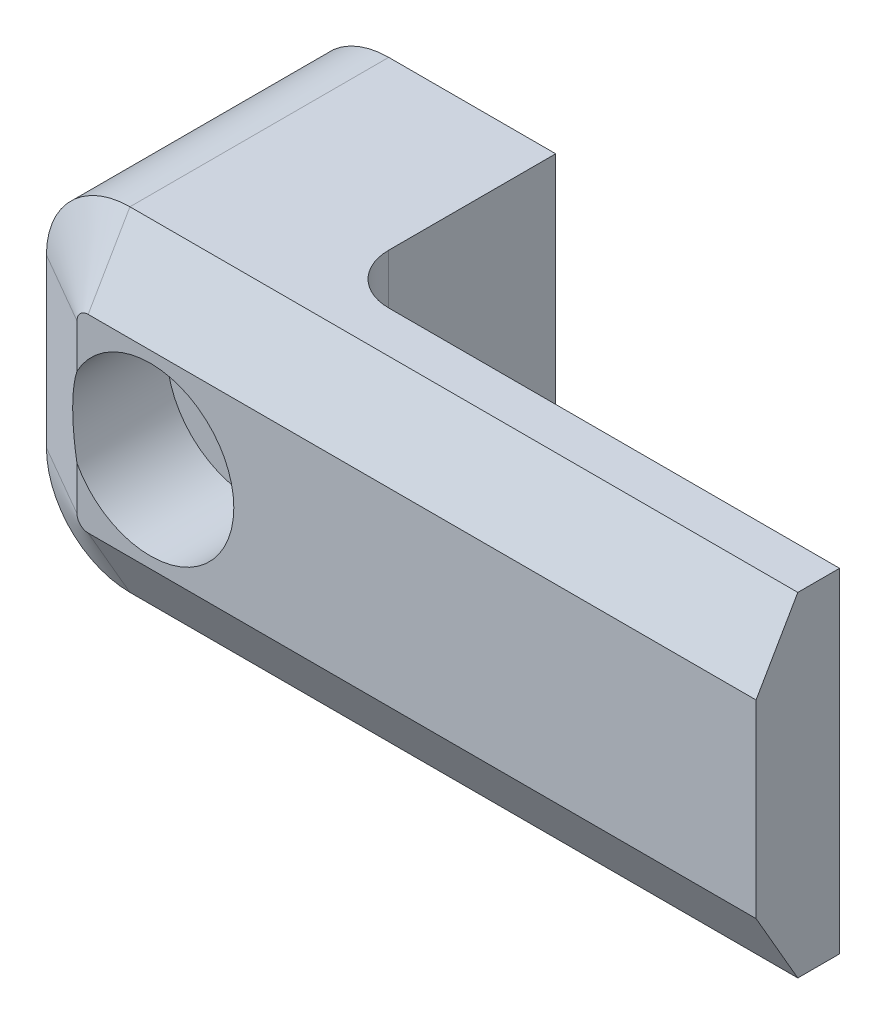
ISO-10303-21;
HEADER;
FILE_DESCRIPTION(('STEP AP214'),'2;1');
FILE_NAME('part.step','',(''),(''),'','','');
FILE_SCHEMA(('AUTOMOTIVE_DESIGN { 1 0 10303 214 1 1 1 1 }'));
ENDSEC;
DATA;
#1=APPLICATION_CONTEXT('core data for automotive mechanical design processes');
#2=APPLICATION_PROTOCOL_DEFINITION('international standard','automotive_design',2000,#1);
#3=PRODUCT_CONTEXT('',#1,'mechanical');
#4=PRODUCT('Part','Part','',(#3));
#5=PRODUCT_RELATED_PRODUCT_CATEGORY('part','',(#4));
#6=PRODUCT_DEFINITION_FORMATION('','',#4);
#7=PRODUCT_DEFINITION_CONTEXT('part definition',#1,'design');
#8=PRODUCT_DEFINITION('design','',#6,#7);
#9=PRODUCT_DEFINITION_SHAPE('','',#8);
#10=(LENGTH_UNIT() NAMED_UNIT(*) SI_UNIT(.MILLI.,.METRE.));
#11=(NAMED_UNIT(*) PLANE_ANGLE_UNIT() SI_UNIT($,.RADIAN.));
#12=(NAMED_UNIT(*) SI_UNIT($,.STERADIAN.) SOLID_ANGLE_UNIT());
#13=UNCERTAINTY_MEASURE_WITH_UNIT(LENGTH_MEASURE(1.E-05),#10,'distance_accuracy_value','');
#14=(GEOMETRIC_REPRESENTATION_CONTEXT(3) GLOBAL_UNCERTAINTY_ASSIGNED_CONTEXT((#13)) GLOBAL_UNIT_ASSIGNED_CONTEXT((#10,
#11,#12)) REPRESENTATION_CONTEXT('',''));
#15=CARTESIAN_POINT('',(0.,0.,0.));
#16=DIRECTION('',(0.,0.,1.));
#17=DIRECTION('',(1.,0.,0.));
#18=AXIS2_PLACEMENT_3D('',#15,#16,#17);
#19=CARTESIAN_POINT('',(-4.5,10.,-3.));
#20=DIRECTION('',(0.,1.,0.));
#21=DIRECTION('',(-1.,0.,0.));
#22=AXIS2_PLACEMENT_3D('',#19,#20,#21);
#23=CYLINDRICAL_SURFACE('',#22,3.);
#24=DIRECTION('',(0.,-1.,0.));
#25=VECTOR('',#24,1.);
#26=CARTESIAN_POINT('',(-7.5,10.,-3.));
#27=LINE('',#26,#25);
#28=CARTESIAN_POINT('',(-7.5,10.,-3.));
#29=VERTEX_POINT('',#28);
#30=CARTESIAN_POINT('',(-7.50000000000001,-10.,-3.));
#31=VERTEX_POINT('',#30);
#32=EDGE_CURVE('E165',#29,#31,#27,.T.);
#33=ORIENTED_EDGE('',*,*,#32,.F.);
#34=CARTESIAN_POINT('',(-4.5,10.,-3.));
#35=DIRECTION('',(0.,-1.,0.));
#36=DIRECTION('',(1.,0.,0.));
#37=AXIS2_PLACEMENT_3D('',#34,#35,#36);
#38=CIRCLE('',#37,3.);
#39=CARTESIAN_POINT('',(-4.5,10.,0.));
#40=VERTEX_POINT('',#39);
#41=EDGE_CURVE('E39',#29,#40,#38,.F.);
#42=ORIENTED_EDGE('',*,*,#41,.T.);
#43=DIRECTION('',(0.,-1.,0.));
#44=VECTOR('',#43,1.);
#45=CARTESIAN_POINT('',(-4.5,10.,0.));
#46=LINE('',#45,#44);
#47=CARTESIAN_POINT('',(-4.5,-10.,0.));
#48=VERTEX_POINT('',#47);
#49=EDGE_CURVE('E167',#48,#40,#46,.F.);
#50=ORIENTED_EDGE('',*,*,#49,.F.);
#51=CARTESIAN_POINT('',(-4.50000000000001,-10.,-3.));
#52=DIRECTION('',(0.,1.,0.));
#53=DIRECTION('',(-1.,0.,0.));
#54=AXIS2_PLACEMENT_3D('',#51,#52,#53);
#55=CIRCLE('',#54,3.);
#56=EDGE_CURVE('E11',#48,#31,#55,.F.);
#57=ORIENTED_EDGE('',*,*,#56,.T.);
#58=EDGE_LOOP('',(#33,#42,#50,#57));
#59=FACE_BOUND('',#58,.T.);
#60=ADVANCED_FACE('F32',(#59),#23,.F.);
#61=CARTESIAN_POINT('',(0.,0.,0.));
#62=DIRECTION('',(0.,0.,1.));
#63=DIRECTION('',(1.,0.,0.));
#64=AXIS2_PLACEMENT_3D('',#61,#62,#63);
#65=PLANE('',#64);
#66=DIRECTION('',(1.,0.,0.));
#67=VECTOR('',#66,1.);
#68=CARTESIAN_POINT('',(22.5,-10.,0.));
#69=LINE('',#68,#67);
#70=CARTESIAN_POINT('',(22.5,-10.,0.));
#71=VERTEX_POINT('',#70);
#72=EDGE_CURVE('E143',#48,#71,#69,.T.);
#73=ORIENTED_EDGE('',*,*,#72,.F.);
#74=ORIENTED_EDGE('',*,*,#49,.T.);
#75=DIRECTION('',(-1.,0.,0.));
#76=VECTOR('',#75,1.);
#77=CARTESIAN_POINT('',(22.5,10.,0.));
#78=LINE('',#77,#76);
#79=CARTESIAN_POINT('',(22.5,10.,0.));
#80=VERTEX_POINT('',#79);
#81=EDGE_CURVE('E157',#80,#40,#78,.T.);
#82=ORIENTED_EDGE('',*,*,#81,.F.);
#83=DIRECTION('',(0.,1.,0.));
#84=VECTOR('',#83,1.);
#85=CARTESIAN_POINT('',(22.5,-10.,0.));
#86=LINE('',#85,#84);
#87=EDGE_CURVE('E160',#71,#80,#86,.T.);
#88=ORIENTED_EDGE('',*,*,#87,.F.);
#89=EDGE_LOOP('',(#73,#74,#82,#88));
#90=FACE_BOUND('',#89,.T.);
#91=ADVANCED_FACE('F281',(#90),#65,.F.);
#92=CARTESIAN_POINT('',(-22.5,-10.,5.));
#93=DIRECTION('',(1.,0.,0.));
#94=DIRECTION('',(0.,0.,-1.));
#95=AXIS2_PLACEMENT_3D('',#92,#93,#94);
#96=PLANE('',#95);
#97=DIRECTION('',(0.,0.,-1.));
#98=VECTOR('',#97,1.);
#99=CARTESIAN_POINT('',(-22.5,-5.,5.));
#100=LINE('',#99,#98);
#101=CARTESIAN_POINT('',(-22.5,-5.,-13.));
#102=VERTEX_POINT('',#101);
#103=CARTESIAN_POINT('',(-22.5,-5.,2.49999999999999));
#104=VERTEX_POINT('',#103);
#105=EDGE_CURVE('E215',#102,#104,#100,.F.);
#106=ORIENTED_EDGE('',*,*,#105,.T.);
#107=DIRECTION('',(0.,1.,0.));
#108=VECTOR('',#107,1.);
#109=CARTESIAN_POINT('',(-22.5,5.,2.49999999999999));
#110=LINE('',#109,#108);
#111=CARTESIAN_POINT('',(-22.5,5.,2.49999999999999));
#112=VERTEX_POINT('',#111);
#113=EDGE_CURVE('E176',#104,#112,#110,.T.);
#114=ORIENTED_EDGE('',*,*,#113,.T.);
#115=DIRECTION('',(0.,0.,-1.));
#116=VECTOR('',#115,1.);
#117=CARTESIAN_POINT('',(-22.5,5.,5.));
#118=LINE('',#117,#116);
#119=CARTESIAN_POINT('',(-22.5,5.,-13.));
#120=VERTEX_POINT('',#119);
#121=EDGE_CURVE('E218',#112,#120,#118,.T.);
#122=ORIENTED_EDGE('',*,*,#121,.T.);
#123=DIRECTION('',(0.,1.,0.));
#124=VECTOR('',#123,1.);
#125=CARTESIAN_POINT('',(-22.5,10.,-13.));
#126=LINE('',#125,#124);
#127=EDGE_CURVE('E135',#102,#120,#126,.T.);
#128=ORIENTED_EDGE('',*,*,#127,.F.);
#129=EDGE_LOOP('',(#106,#114,#122,#128));
#130=FACE_BOUND('',#129,.T.);
#131=ADVANCED_FACE('F214',(#130),#96,.F.);
#132=CARTESIAN_POINT('',(22.5,-10.,5.));
#133=DIRECTION('',(0.,1.,0.));
#134=DIRECTION('',(-1.,0.,0.));
#135=AXIS2_PLACEMENT_3D('',#132,#133,#134);
#136=PLANE('',#135);
#137=ORIENTED_EDGE('',*,*,#56,.F.);
#138=ORIENTED_EDGE('',*,*,#72,.T.);
#139=DIRECTION('',(0.,0.,-1.));
#140=VECTOR('',#139,1.);
#141=CARTESIAN_POINT('',(22.5,-10.,5.));
#142=LINE('',#141,#140);
#143=CARTESIAN_POINT('',(22.5,-10.,2.49999999999999));
#144=VERTEX_POINT('',#143);
#145=EDGE_CURVE('E291',#144,#71,#142,.T.);
#146=ORIENTED_EDGE('',*,*,#145,.F.);
#147=DIRECTION('',(-1.,0.,0.));
#148=VECTOR('',#147,1.);
#149=CARTESIAN_POINT('',(-17.5,-10.,2.49999999999999));
#150=LINE('',#149,#148);
#151=CARTESIAN_POINT('',(-17.5,-10.,2.49999999999999));
#152=VERTEX_POINT('',#151);
#153=EDGE_CURVE('E247',#144,#152,#150,.T.);
#154=ORIENTED_EDGE('',*,*,#153,.T.);
#155=DIRECTION('',(0.,0.,-1.));
#156=VECTOR('',#155,1.);
#157=CARTESIAN_POINT('',(-17.5,-10.,5.));
#158=LINE('',#157,#156);
#159=CARTESIAN_POINT('',(-17.5,-10.,-13.));
#160=VERTEX_POINT('',#159);
#161=EDGE_CURVE('E296',#152,#160,#158,.T.);
#162=ORIENTED_EDGE('',*,*,#161,.T.);
#163=DIRECTION('',(-1.,0.,0.));
#164=VECTOR('',#163,1.);
#165=CARTESIAN_POINT('',(-22.5,-10.,-13.));
#166=LINE('',#165,#164);
#167=CARTESIAN_POINT('',(-7.50000000000001,-10.,-13.));
#168=VERTEX_POINT('',#167);
#169=EDGE_CURVE('E148',#168,#160,#166,.T.);
#170=ORIENTED_EDGE('',*,*,#169,.F.);
#171=DIRECTION('',(0.,0.,1.));
#172=VECTOR('',#171,1.);
#173=CARTESIAN_POINT('',(-7.50000000000001,-10.,-13.));
#174=LINE('',#173,#172);
#175=EDGE_CURVE('E144',#168,#31,#174,.T.);
#176=ORIENTED_EDGE('',*,*,#175,.T.);
#177=EDGE_LOOP('',(#137,#138,#146,#154,#162,#170,#176));
#178=FACE_BOUND('',#177,.T.);
#179=ADVANCED_FACE('F290',(#178),#136,.F.);
#180=CARTESIAN_POINT('',(22.5,-10.,5.));
#181=DIRECTION('',(-1.,0.,0.));
#182=DIRECTION('',(0.,0.,1.));
#183=AXIS2_PLACEMENT_3D('',#180,#181,#182);
#184=PLANE('',#183);
#185=DIRECTION('',(0.,1.,0.));
#186=VECTOR('',#185,1.);
#187=CARTESIAN_POINT('',(22.5,-10.,5.));
#188=LINE('',#187,#186);
#189=CARTESIAN_POINT('',(22.5,-5.66987298107781,5.));
#190=VERTEX_POINT('',#189);
#191=CARTESIAN_POINT('',(22.5,5.6698729810778,5.));
#192=VERTEX_POINT('',#191);
#193=EDGE_CURVE('E153',#190,#192,#188,.T.);
#194=ORIENTED_EDGE('',*,*,#193,.F.);
#195=DIRECTION('',(0.,-0.866025403784438,-0.500000000000001));
#196=VECTOR('',#195,1.);
#197=CARTESIAN_POINT('',(22.5,-5.66987298107781,5.));
#198=LINE('',#197,#196);
#199=EDGE_CURVE('E245',#190,#144,#198,.T.);
#200=ORIENTED_EDGE('',*,*,#199,.T.);
#201=ORIENTED_EDGE('',*,*,#145,.T.);
#202=ORIENTED_EDGE('',*,*,#87,.T.);
#203=DIRECTION('',(0.,0.,-1.));
#204=VECTOR('',#203,1.);
#205=CARTESIAN_POINT('',(22.5,10.,5.));
#206=LINE('',#205,#204);
#207=CARTESIAN_POINT('',(22.5,10.,2.49999999999999));
#208=VERTEX_POINT('',#207);
#209=EDGE_CURVE('E156',#208,#80,#206,.T.);
#210=ORIENTED_EDGE('',*,*,#209,.F.);
#211=DIRECTION('',(0.,-0.866025403784438,0.500000000000001));
#212=VECTOR('',#211,1.);
#213=CARTESIAN_POINT('',(22.5,5.66987298107781,5.));
#214=LINE('',#213,#212);
#215=EDGE_CURVE('E243',#208,#192,#214,.T.);
#216=ORIENTED_EDGE('',*,*,#215,.T.);
#217=EDGE_LOOP('',(#194,#200,#201,#202,#210,#216));
#218=FACE_BOUND('',#217,.T.);
#219=ADVANCED_FACE('F295',(#218),#184,.F.);
#220=CARTESIAN_POINT('',(22.5,10.,5.));
#221=DIRECTION('',(0.,-1.,0.));
#222=DIRECTION('',(1.,0.,0.));
#223=AXIS2_PLACEMENT_3D('',#220,#221,#222);
#224=PLANE('',#223);
#225=DIRECTION('',(0.,0.,-1.));
#226=VECTOR('',#225,1.);
#227=CARTESIAN_POINT('',(-17.5,10.,5.));
#228=LINE('',#227,#226);
#229=CARTESIAN_POINT('',(-17.5,10.,-13.));
#230=VERTEX_POINT('',#229);
#231=CARTESIAN_POINT('',(-17.5,10.,2.49999999999999));
#232=VERTEX_POINT('',#231);
#233=EDGE_CURVE('E224',#230,#232,#228,.F.);
#234=ORIENTED_EDGE('',*,*,#233,.T.);
#235=DIRECTION('',(1.,0.,0.));
#236=VECTOR('',#235,1.);
#237=CARTESIAN_POINT('',(22.5,10.,2.49999999999999));
#238=LINE('',#237,#236);
#239=EDGE_CURVE('E171',#232,#208,#238,.T.);
#240=ORIENTED_EDGE('',*,*,#239,.T.);
#241=ORIENTED_EDGE('',*,*,#209,.T.);
#242=ORIENTED_EDGE('',*,*,#81,.T.);
#243=ORIENTED_EDGE('',*,*,#41,.F.);
#244=DIRECTION('',(0.,0.,1.));
#245=VECTOR('',#244,1.);
#246=CARTESIAN_POINT('',(-7.5,10.,-13.));
#247=LINE('',#246,#245);
#248=CARTESIAN_POINT('',(-7.5,10.,-13.));
#249=VERTEX_POINT('',#248);
#250=EDGE_CURVE('E138',#249,#29,#247,.T.);
#251=ORIENTED_EDGE('',*,*,#250,.F.);
#252=DIRECTION('',(1.,0.,0.));
#253=VECTOR('',#252,1.);
#254=CARTESIAN_POINT('',(-22.5,10.,-13.));
#255=LINE('',#254,#253);
#256=EDGE_CURVE('E122',#230,#249,#255,.T.);
#257=ORIENTED_EDGE('',*,*,#256,.F.);
#258=EDGE_LOOP('',(#234,#240,#241,#242,#243,#251,#257));
#259=FACE_BOUND('',#258,.T.);
#260=ADVANCED_FACE('F139',(#259),#224,.F.);
#261=CARTESIAN_POINT('',(0.,0.,5.));
#262=DIRECTION('',(0.,0.,1.));
#263=DIRECTION('',(1.,0.,0.));
#264=AXIS2_PLACEMENT_3D('',#261,#262,#263);
#265=PLANE('',#264);
#266=CARTESIAN_POINT('',(-17.5,-5.,5.));
#267=DIRECTION('',(0.,0.,1.));
#268=DIRECTION('',(1.,0.,0.));
#269=AXIS2_PLACEMENT_3D('',#266,#267,#268);
#270=CIRCLE('',#269,0.669872981077808);
#271=CARTESIAN_POINT('',(-18.1698729810778,-5.,5.));
#272=VERTEX_POINT('',#271);
#273=CARTESIAN_POINT('',(-17.5,-5.66987298107781,5.));
#274=VERTEX_POINT('',#273);
#275=EDGE_CURVE('E238',#272,#274,#270,.T.);
#276=ORIENTED_EDGE('',*,*,#275,.T.);
#277=DIRECTION('',(1.,0.,0.));
#278=VECTOR('',#277,1.);
#279=CARTESIAN_POINT('',(22.5,-5.6698729810778,5.));
#280=LINE('',#279,#278);
#281=EDGE_CURVE('E240',#274,#190,#280,.T.);
#282=ORIENTED_EDGE('',*,*,#281,.T.);
#283=ORIENTED_EDGE('',*,*,#193,.T.);
#284=DIRECTION('',(-1.,0.,0.));
#285=VECTOR('',#284,1.);
#286=CARTESIAN_POINT('',(-17.5,5.6698729810778,5.));
#287=LINE('',#286,#285);
#288=CARTESIAN_POINT('',(-17.5,5.6698729810778,5.));
#289=VERTEX_POINT('',#288);
#290=EDGE_CURVE('E226',#192,#289,#287,.T.);
#291=ORIENTED_EDGE('',*,*,#290,.T.);
#292=CARTESIAN_POINT('',(-17.5,5.,5.));
#293=DIRECTION('',(0.,0.,1.));
#294=DIRECTION('',(1.,0.,0.));
#295=AXIS2_PLACEMENT_3D('',#292,#293,#294);
#296=CIRCLE('',#295,0.669872981077808);
#297=CARTESIAN_POINT('',(-18.1698729810778,5.,5.));
#298=VERTEX_POINT('',#297);
#299=EDGE_CURVE('E232',#289,#298,#296,.T.);
#300=ORIENTED_EDGE('',*,*,#299,.T.);
#301=DIRECTION('',(0.,-1.,0.));
#302=VECTOR('',#301,1.);
#303=CARTESIAN_POINT('',(-18.1698729810778,-5.,5.));
#304=LINE('',#303,#302);
#305=CARTESIAN_POINT('',(-18.1698729810778,2.39061685274893,5.));
#306=VERTEX_POINT('',#305);
#307=EDGE_CURVE('E234',#298,#306,#304,.T.);
#308=ORIENTED_EDGE('',*,*,#307,.T.);
#309=CARTESIAN_POINT('',(-13.7784095503576,0.,5.));
#310=DIRECTION('',(0.,0.,1.));
#311=DIRECTION('',(1.,0.,0.));
#312=AXIS2_PLACEMENT_3D('',#309,#310,#311);
#313=CIRCLE('',#312,5.);
#314=CARTESIAN_POINT('',(-18.1698729810778,-2.39061685274893,5.));
#315=VERTEX_POINT('',#314);
#316=EDGE_CURVE('E201',#315,#306,#313,.T.);
#317=ORIENTED_EDGE('',*,*,#316,.F.);
#318=DIRECTION('',(0.,-1.,0.));
#319=VECTOR('',#318,1.);
#320=CARTESIAN_POINT('',(-18.1698729810778,-5.,5.));
#321=LINE('',#320,#319);
#322=EDGE_CURVE('E236',#315,#272,#321,.T.);
#323=ORIENTED_EDGE('',*,*,#322,.T.);
#324=EDGE_LOOP('',(#276,#282,#283,#291,#300,#308,#317,#323));
#325=FACE_BOUND('',#324,.T.);
#326=ADVANCED_FACE('F263',(#325),#265,.T.);
#327=CARTESIAN_POINT('',(-7.5,10.,-13.));
#328=DIRECTION('',(-1.,0.,0.));
#329=DIRECTION('',(0.,-1.,0.));
#330=AXIS2_PLACEMENT_3D('',#327,#328,#329);
#331=PLANE('',#330);
#332=ORIENTED_EDGE('',*,*,#250,.T.);
#333=ORIENTED_EDGE('',*,*,#32,.T.);
#334=ORIENTED_EDGE('',*,*,#175,.F.);
#335=DIRECTION('',(0.,-1.,0.));
#336=VECTOR('',#335,1.);
#337=CARTESIAN_POINT('',(-7.5,10.,-13.));
#338=LINE('',#337,#336);
#339=EDGE_CURVE('E127',#249,#168,#338,.T.);
#340=ORIENTED_EDGE('',*,*,#339,.F.);
#341=EDGE_LOOP('',(#332,#333,#334,#340));
#342=FACE_BOUND('',#341,.T.);
#343=ADVANCED_FACE('F146',(#342),#331,.F.);
#344=CARTESIAN_POINT('',(0.,0.,-13.));
#345=DIRECTION('',(0.,0.,1.));
#346=DIRECTION('',(1.,0.,0.));
#347=AXIS2_PLACEMENT_3D('',#344,#345,#346);
#348=PLANE('',#347);
#349=CARTESIAN_POINT('',(-13.7784095503576,0.,-13.));
#350=DIRECTION('',(0.,0.,1.));
#351=DIRECTION('',(1.,0.,0.));
#352=AXIS2_PLACEMENT_3D('',#349,#350,#351);
#353=CIRCLE('',#352,2.5);
#354=CARTESIAN_POINT('',(-11.2784095503576,0.,-13.));
#355=VERTEX_POINT('',#354);
#356=EDGE_CURVE('E196',#355,#355,#353,.T.);
#357=ORIENTED_EDGE('',*,*,#356,.T.);
#358=EDGE_LOOP('',(#357));
#359=FACE_BOUND('',#358,.T.);
#360=ORIENTED_EDGE('',*,*,#169,.T.);
#361=CARTESIAN_POINT('',(-17.5,-5.,-13.));
#362=DIRECTION('',(0.,0.,1.));
#363=DIRECTION('',(1.,0.,0.));
#364=AXIS2_PLACEMENT_3D('',#361,#362,#363);
#365=CIRCLE('',#364,5.);
#366=EDGE_CURVE('E210',#160,#102,#365,.F.);
#367=ORIENTED_EDGE('',*,*,#366,.T.);
#368=ORIENTED_EDGE('',*,*,#127,.T.);
#369=CARTESIAN_POINT('',(-17.5,5.,-13.));
#370=DIRECTION('',(0.,0.,1.));
#371=DIRECTION('',(1.,0.,0.));
#372=AXIS2_PLACEMENT_3D('',#369,#370,#371);
#373=CIRCLE('',#372,5.);
#374=EDGE_CURVE('E131',#120,#230,#373,.F.);
#375=ORIENTED_EDGE('',*,*,#374,.T.);
#376=ORIENTED_EDGE('',*,*,#256,.T.);
#377=ORIENTED_EDGE('',*,*,#339,.T.);
#378=EDGE_LOOP('',(#360,#367,#368,#375,#376,#377));
#379=FACE_BOUND('',#378,.T.);
#380=ADVANCED_FACE('F125',(#359,#379),#348,.F.);
#381=CARTESIAN_POINT('',(-13.7784095503576,0.,-1.));
#382=DIRECTION('',(0.,0.,1.));
#383=DIRECTION('',(1.,0.,0.));
#384=AXIS2_PLACEMENT_3D('',#381,#382,#383);
#385=CYLINDRICAL_SURFACE('',#384,5.);
#386=CARTESIAN_POINT('',(-13.7784095503576,0.,-1.));
#387=DIRECTION('',(0.,0.,1.));
#388=DIRECTION('',(1.,0.,0.));
#389=AXIS2_PLACEMENT_3D('',#386,#387,#388);
#390=CIRCLE('',#389,5.);
#391=CARTESIAN_POINT('',(-8.77840955035761,0.,-1.));
#392=VERTEX_POINT('',#391);
#393=EDGE_CURVE('E204',#392,#392,#390,.T.);
#394=ORIENTED_EDGE('',*,*,#393,.F.);
#395=EDGE_LOOP('',(#394));
#396=FACE_BOUND('',#395,.T.);
#397=ORIENTED_EDGE('',*,*,#316,.T.);
#398=CARTESIAN_POINT('',(-13.7784095503576,0.,7.53541259386272));
#399=DIRECTION('',(-0.500000000000001,0.,0.866025403784438));
#400=DIRECTION('',(0.866025403784438,0.,0.500000000000001));
#401=AXIS2_PLACEMENT_3D('',#398,#399,#400);
#402=ELLIPSE('',#401,5.77350269189627,5.);
#403=EDGE_CURVE('E250',#306,#315,#402,.T.);
#404=ORIENTED_EDGE('',*,*,#403,.T.);
#405=EDGE_LOOP('',(#397,#404));
#406=FACE_BOUND('',#405,.T.);
#407=ADVANCED_FACE('F265',(#396,#406),#385,.F.);
#408=CARTESIAN_POINT('',(-13.7784095503576,0.,-1.));
#409=DIRECTION('',(0.,0.,1.));
#410=DIRECTION('',(1.,0.,0.));
#411=AXIS2_PLACEMENT_3D('',#408,#409,#410);
#412=PLANE('',#411);
#413=CARTESIAN_POINT('',(-13.7784095503576,0.,-1.));
#414=DIRECTION('',(0.,0.,1.));
#415=DIRECTION('',(1.,0.,0.));
#416=AXIS2_PLACEMENT_3D('',#413,#414,#415);
#417=CIRCLE('',#416,2.5);
#418=CARTESIAN_POINT('',(-11.2784095503576,0.,-1.));
#419=VERTEX_POINT('',#418);
#420=EDGE_CURVE('E190',#419,#419,#417,.T.);
#421=ORIENTED_EDGE('',*,*,#420,.F.);
#422=EDGE_LOOP('',(#421));
#423=FACE_BOUND('',#422,.T.);
#424=ORIENTED_EDGE('',*,*,#393,.T.);
#425=EDGE_LOOP('',(#424));
#426=FACE_BOUND('',#425,.T.);
#427=ADVANCED_FACE('F267',(#423,#426),#412,.T.);
#428=CARTESIAN_POINT('',(-13.7784095503576,0.,-17.));
#429=DIRECTION('',(0.,0.,1.));
#430=DIRECTION('',(1.,0.,0.));
#431=AXIS2_PLACEMENT_3D('',#428,#429,#430);
#432=CYLINDRICAL_SURFACE('',#431,2.5);
#433=ORIENTED_EDGE('',*,*,#420,.T.);
#434=EDGE_LOOP('',(#433));
#435=FACE_BOUND('',#434,.T.);
#436=ORIENTED_EDGE('',*,*,#356,.F.);
#437=EDGE_LOOP('',(#436));
#438=FACE_BOUND('',#437,.T.);
#439=ADVANCED_FACE('F274',(#435,#438),#432,.F.);
#440=CARTESIAN_POINT('',(-17.5,-5.,5.));
#441=DIRECTION('',(0.,0.,-1.));
#442=DIRECTION('',(-1.,0.,0.));
#443=AXIS2_PLACEMENT_3D('',#440,#441,#442);
#444=CYLINDRICAL_SURFACE('',#443,5.);
#445=ORIENTED_EDGE('',*,*,#161,.F.);
#446=CARTESIAN_POINT('',(-17.5,-5.,2.49999999999999));
#447=DIRECTION('',(0.,0.,1.));
#448=DIRECTION('',(1.,0.,0.));
#449=AXIS2_PLACEMENT_3D('',#446,#447,#448);
#450=CIRCLE('',#449,5.);
#451=EDGE_CURVE('E223',#152,#104,#450,.F.);
#452=ORIENTED_EDGE('',*,*,#451,.T.);
#453=ORIENTED_EDGE('',*,*,#105,.F.);
#454=ORIENTED_EDGE('',*,*,#366,.F.);
#455=EDGE_LOOP('',(#445,#452,#453,#454));
#456=FACE_BOUND('',#455,.T.);
#457=ADVANCED_FACE('F221',(#456),#444,.T.);
#458=CARTESIAN_POINT('',(-17.5,5.,5.));
#459=DIRECTION('',(0.,0.,-1.));
#460=DIRECTION('',(-1.,0.,0.));
#461=AXIS2_PLACEMENT_3D('',#458,#459,#460);
#462=CYLINDRICAL_SURFACE('',#461,5.);
#463=ORIENTED_EDGE('',*,*,#121,.F.);
#464=CARTESIAN_POINT('',(-17.5,5.,2.49999999999999));
#465=DIRECTION('',(0.,0.,1.));
#466=DIRECTION('',(1.,0.,0.));
#467=AXIS2_PLACEMENT_3D('',#464,#465,#466);
#468=CIRCLE('',#467,5.);
#469=EDGE_CURVE('E172',#112,#232,#468,.F.);
#470=ORIENTED_EDGE('',*,*,#469,.T.);
#471=ORIENTED_EDGE('',*,*,#233,.F.);
#472=ORIENTED_EDGE('',*,*,#374,.F.);
#473=EDGE_LOOP('',(#463,#470,#471,#472));
#474=FACE_BOUND('',#473,.T.);
#475=ADVANCED_FACE('F254',(#474),#462,.T.);
#476=CARTESIAN_POINT('',(0.,5.66987298107781,5.));
#477=DIRECTION('',(0.,0.500000000000001,0.866025403784438));
#478=DIRECTION('',(1.,0.,0.));
#479=AXIS2_PLACEMENT_3D('',#476,#477,#478);
#480=PLANE('',#479);
#481=ORIENTED_EDGE('',*,*,#215,.F.);
#482=ORIENTED_EDGE('',*,*,#239,.F.);
#483=DIRECTION('',(0.,0.866025403784438,-0.500000000000001));
#484=VECTOR('',#483,1.);
#485=CARTESIAN_POINT('',(-17.5,5.6698729810778,5.));
#486=LINE('',#485,#484);
#487=EDGE_CURVE('E188',#289,#232,#486,.T.);
#488=ORIENTED_EDGE('',*,*,#487,.F.);
#489=ORIENTED_EDGE('',*,*,#290,.F.);
#490=EDGE_LOOP('',(#481,#482,#488,#489));
#491=FACE_BOUND('',#490,.T.);
#492=ADVANCED_FACE('F318',(#491),#480,.T.);
#493=CARTESIAN_POINT('',(-17.5,5.,5.));
#494=DIRECTION('',(0.,0.,-1.));
#495=DIRECTION('',(-1.,0.,0.));
#496=AXIS2_PLACEMENT_3D('',#493,#494,#495);
#497=CONICAL_SURFACE('',#496,0.669872981077807,1.0471975511966);
#498=ORIENTED_EDGE('',*,*,#487,.T.);
#499=ORIENTED_EDGE('',*,*,#469,.F.);
#500=DIRECTION('',(-0.866025403784438,0.,-0.500000000000001));
#501=VECTOR('',#500,1.);
#502=CARTESIAN_POINT('',(-18.1698729810778,5.,5.));
#503=LINE('',#502,#501);
#504=EDGE_CURVE('E186',#298,#112,#503,.T.);
#505=ORIENTED_EDGE('',*,*,#504,.F.);
#506=ORIENTED_EDGE('',*,*,#299,.F.);
#507=EDGE_LOOP('',(#498,#499,#505,#506));
#508=FACE_BOUND('',#507,.T.);
#509=ADVANCED_FACE('F256',(#508),#497,.T.);
#510=CARTESIAN_POINT('',(-18.1698729810778,0.,5.));
#511=DIRECTION('',(-0.500000000000001,0.,0.866025403784438));
#512=DIRECTION('',(0.,1.,0.));
#513=AXIS2_PLACEMENT_3D('',#510,#511,#512);
#514=PLANE('',#513);
#515=ORIENTED_EDGE('',*,*,#504,.T.);
#516=ORIENTED_EDGE('',*,*,#113,.F.);
#517=DIRECTION('',(-0.866025403784438,0.,-0.500000000000001));
#518=VECTOR('',#517,1.);
#519=CARTESIAN_POINT('',(-18.1698729810778,-5.,5.));
#520=LINE('',#519,#518);
#521=EDGE_CURVE('E183',#272,#104,#520,.T.);
#522=ORIENTED_EDGE('',*,*,#521,.F.);
#523=ORIENTED_EDGE('',*,*,#322,.F.);
#524=ORIENTED_EDGE('',*,*,#403,.F.);
#525=ORIENTED_EDGE('',*,*,#307,.F.);
#526=EDGE_LOOP('',(#515,#516,#522,#523,#524,#525));
#527=FACE_BOUND('',#526,.T.);
#528=ADVANCED_FACE('F258',(#527),#514,.T.);
#529=CARTESIAN_POINT('',(-17.5,-5.,5.));
#530=DIRECTION('',(0.,0.,-1.));
#531=DIRECTION('',(-1.,0.,0.));
#532=AXIS2_PLACEMENT_3D('',#529,#530,#531);
#533=CONICAL_SURFACE('',#532,0.669872981077808,1.0471975511966);
#534=ORIENTED_EDGE('',*,*,#521,.T.);
#535=ORIENTED_EDGE('',*,*,#451,.F.);
#536=DIRECTION('',(0.,-0.866025403784438,-0.500000000000002));
#537=VECTOR('',#536,1.);
#538=CARTESIAN_POINT('',(-17.5,-5.66987298107781,5.));
#539=LINE('',#538,#537);
#540=EDGE_CURVE('E180',#274,#152,#539,.T.);
#541=ORIENTED_EDGE('',*,*,#540,.F.);
#542=ORIENTED_EDGE('',*,*,#275,.F.);
#543=EDGE_LOOP('',(#534,#535,#541,#542));
#544=FACE_BOUND('',#543,.T.);
#545=ADVANCED_FACE('F310',(#544),#533,.T.);
#546=CARTESIAN_POINT('',(0.,-5.66987298107781,5.));
#547=DIRECTION('',(0.,-0.500000000000001,0.866025403784438));
#548=DIRECTION('',(-1.,0.,0.));
#549=AXIS2_PLACEMENT_3D('',#546,#547,#548);
#550=PLANE('',#549);
#551=ORIENTED_EDGE('',*,*,#540,.T.);
#552=ORIENTED_EDGE('',*,*,#153,.F.);
#553=ORIENTED_EDGE('',*,*,#199,.F.);
#554=ORIENTED_EDGE('',*,*,#281,.F.);
#555=EDGE_LOOP('',(#551,#552,#553,#554));
#556=FACE_BOUND('',#555,.T.);
#557=ADVANCED_FACE('F314',(#556),#550,.T.);
#558=CLOSED_SHELL('',(#60,#91,#131,#179,#219,#260,#326,#343,#380,#407,#427,#439,#457,#475,#492,
#509,#528,#545,#557));
#559=MANIFOLD_SOLID_BREP('B2',#558);
#560=ADVANCED_BREP_SHAPE_REPRESENTATION('',(#18,#559),#14);
#561=SHAPE_DEFINITION_REPRESENTATION(#9,#560);
ENDSEC;
END-ISO-10303-21;
